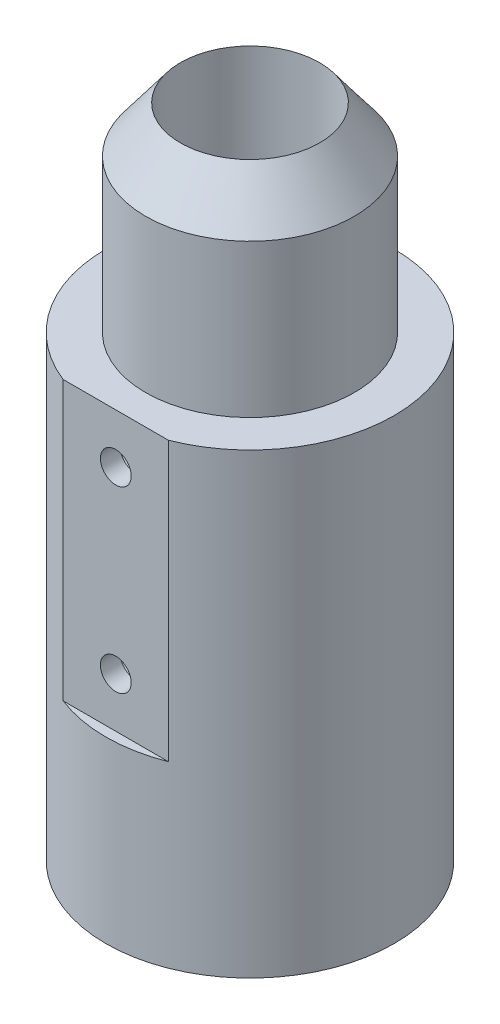
ISO-10303-21;
HEADER;
FILE_DESCRIPTION(('STEP AP214'),'2;1');
FILE_NAME('part.step','',(''),(''),'','','');
FILE_SCHEMA(('AUTOMOTIVE_DESIGN { 1 0 10303 214 1 1 1 1 }'));
ENDSEC;
DATA;
#1=APPLICATION_CONTEXT('core data for automotive mechanical design processes');
#2=APPLICATION_PROTOCOL_DEFINITION('international standard','automotive_design',2000,#1);
#3=PRODUCT_CONTEXT('',#1,'mechanical');
#4=PRODUCT('Part','Part','',(#3));
#5=PRODUCT_RELATED_PRODUCT_CATEGORY('part','',(#4));
#6=PRODUCT_DEFINITION_FORMATION('','',#4);
#7=PRODUCT_DEFINITION_CONTEXT('part definition',#1,'design');
#8=PRODUCT_DEFINITION('design','',#6,#7);
#9=PRODUCT_DEFINITION_SHAPE('','',#8);
#10=(LENGTH_UNIT() NAMED_UNIT(*) SI_UNIT(.MILLI.,.METRE.));
#11=(NAMED_UNIT(*) PLANE_ANGLE_UNIT() SI_UNIT($,.RADIAN.));
#12=(NAMED_UNIT(*) SI_UNIT($,.STERADIAN.) SOLID_ANGLE_UNIT());
#13=UNCERTAINTY_MEASURE_WITH_UNIT(LENGTH_MEASURE(1.E-05),#10,'distance_accuracy_value','');
#14=(GEOMETRIC_REPRESENTATION_CONTEXT(3) GLOBAL_UNCERTAINTY_ASSIGNED_CONTEXT((#13)) GLOBAL_UNIT_ASSIGNED_CONTEXT((#10,
#11,#12)) REPRESENTATION_CONTEXT('',''));
#15=CARTESIAN_POINT('',(0.,0.,0.));
#16=DIRECTION('',(0.,0.,1.));
#17=DIRECTION('',(1.,0.,0.));
#18=AXIS2_PLACEMENT_3D('',#15,#16,#17);
#19=CARTESIAN_POINT('',(0.,76.2,0.));
#20=DIRECTION('',(0.,-1.,0.));
#21=DIRECTION('',(0.,0.,-1.));
#22=AXIS2_PLACEMENT_3D('',#19,#20,#21);
#23=CYLINDRICAL_SURFACE('',#22,23.01875);
#24=CARTESIAN_POINT('',(0.,76.2,0.));
#25=DIRECTION('',(0.,1.,0.));
#26=DIRECTION('',(0.,0.,1.));
#27=AXIS2_PLACEMENT_3D('',#24,#25,#26);
#28=CIRCLE('',#27,23.01875);
#29=CARTESIAN_POINT('',(8.40026041263007,76.2,21.43125));
#30=VERTEX_POINT('',#29);
#31=CARTESIAN_POINT('',(-8.40026041263007,76.2,21.43125));
#32=VERTEX_POINT('',#31);
#33=EDGE_CURVE('E13',#30,#32,#28,.T.);
#34=ORIENTED_EDGE('',*,*,#33,.F.);
#35=DIRECTION('',(0.,1.,0.));
#36=VECTOR('',#35,1.);
#37=CARTESIAN_POINT('',(8.40026041263007,31.75,21.43125));
#38=LINE('',#37,#36);
#39=CARTESIAN_POINT('',(8.40026041263007,31.75,21.43125));
#40=VERTEX_POINT('',#39);
#41=EDGE_CURVE('E89',#40,#30,#38,.T.);
#42=ORIENTED_EDGE('',*,*,#41,.F.);
#43=CARTESIAN_POINT('',(0.,31.75,0.));
#44=DIRECTION('',(0.,1.,0.));
#45=DIRECTION('',(0.,0.,1.));
#46=AXIS2_PLACEMENT_3D('',#43,#44,#45);
#47=CIRCLE('',#46,23.01875);
#48=CARTESIAN_POINT('',(-8.40026041263007,31.75,21.43125));
#49=VERTEX_POINT('',#48);
#50=EDGE_CURVE('E79',#49,#40,#47,.T.);
#51=ORIENTED_EDGE('',*,*,#50,.F.);
#52=DIRECTION('',(0.,1.,0.));
#53=VECTOR('',#52,1.);
#54=CARTESIAN_POINT('',(-8.40026041263007,31.75,21.43125));
#55=LINE('',#54,#53);
#56=EDGE_CURVE('E132',#49,#32,#55,.T.);
#57=ORIENTED_EDGE('',*,*,#56,.T.);
#58=EDGE_LOOP('',(#34,#42,#51,#57));
#59=FACE_BOUND('',#58,.T.);
#60=CARTESIAN_POINT('',(0.,3.17499999999998,0.));
#61=DIRECTION('',(0.,-1.,0.));
#62=DIRECTION('',(0.,0.,-1.));
#63=AXIS2_PLACEMENT_3D('',#60,#61,#62);
#64=CIRCLE('',#63,23.01875);
#65=CARTESIAN_POINT('',(0.,3.17499999999998,-23.01875));
#66=VERTEX_POINT('',#65);
#67=EDGE_CURVE('E121',#66,#66,#64,.T.);
#68=ORIENTED_EDGE('',*,*,#67,.F.);
#69=EDGE_LOOP('',(#68));
#70=FACE_BOUND('',#69,.T.);
#71=ADVANCED_FACE('F57',(#59,#70),#23,.T.);
#72=CARTESIAN_POINT('',(0.,76.2,0.));
#73=DIRECTION('',(0.,-1.,0.));
#74=DIRECTION('',(0.,0.,-1.));
#75=AXIS2_PLACEMENT_3D('',#72,#73,#74);
#76=CYLINDRICAL_SURFACE('',#75,11.1125);
#77=CARTESIAN_POINT('',(0.,107.95,0.));
#78=DIRECTION('',(0.,-1.,0.));
#79=DIRECTION('',(0.,0.,-1.));
#80=AXIS2_PLACEMENT_3D('',#77,#78,#79);
#81=CIRCLE('',#80,11.1125);
#82=CARTESIAN_POINT('',(0.,107.95,-11.1125));
#83=VERTEX_POINT('',#82);
#84=EDGE_CURVE('E142',#83,#83,#81,.T.);
#85=ORIENTED_EDGE('',*,*,#84,.F.);
#86=EDGE_LOOP('',(#85));
#87=FACE_BOUND('',#86,.T.);
#88=CARTESIAN_POINT('',(0.,0.482348804253477,0.));
#89=DIRECTION('',(0.,1.,0.));
#90=DIRECTION('',(0.,0.,1.));
#91=AXIS2_PLACEMENT_3D('',#88,#89,#90);
#92=CIRCLE('',#91,11.1125);
#93=CARTESIAN_POINT('',(0.,0.482348804253477,11.1125));
#94=VERTEX_POINT('',#93);
#95=EDGE_CURVE('E60',#94,#94,#92,.F.);
#96=ORIENTED_EDGE('',*,*,#95,.T.);
#97=EDGE_LOOP('',(#96));
#98=FACE_BOUND('',#97,.T.);
#99=ADVANCED_FACE('F154',(#87,#98),#76,.F.);
#100=CARTESIAN_POINT('',(0.,76.2,0.));
#101=DIRECTION('',(0.,1.,0.));
#102=DIRECTION('',(0.,0.,1.));
#103=AXIS2_PLACEMENT_3D('',#100,#101,#102);
#104=PLANE('',#103);
#105=DIRECTION('',(-1.,0.,0.));
#106=VECTOR('',#105,1.);
#107=CARTESIAN_POINT('',(8.40026041263007,76.2,21.43125));
#108=LINE('',#107,#106);
#109=EDGE_CURVE('E127',#30,#32,#108,.T.);
#110=ORIENTED_EDGE('',*,*,#109,.F.);
#111=ORIENTED_EDGE('',*,*,#33,.T.);
#112=EDGE_LOOP('',(#110,#111));
#113=FACE_BOUND('',#112,.T.);
#114=CARTESIAN_POINT('',(0.,76.2,0.));
#115=DIRECTION('',(0.,1.,0.));
#116=DIRECTION('',(0.,0.,1.));
#117=AXIS2_PLACEMENT_3D('',#114,#115,#116);
#118=CIRCLE('',#117,16.66875);
#119=CARTESIAN_POINT('',(0.,76.2,16.66875));
#120=VERTEX_POINT('',#119);
#121=EDGE_CURVE('E66',#120,#120,#118,.T.);
#122=ORIENTED_EDGE('',*,*,#121,.F.);
#123=EDGE_LOOP('',(#122));
#124=FACE_BOUND('',#123,.T.);
#125=ADVANCED_FACE('F152',(#113,#124),#104,.T.);
#126=CARTESIAN_POINT('',(0.,107.95,0.));
#127=DIRECTION('',(0.,-1.,0.));
#128=DIRECTION('',(0.,0.,-1.));
#129=AXIS2_PLACEMENT_3D('',#126,#127,#128);
#130=CYLINDRICAL_SURFACE('',#129,16.66875);
#131=CARTESIAN_POINT('',(0.,100.576607209871,0.));
#132=DIRECTION('',(0.,-1.,0.));
#133=DIRECTION('',(0.,0.,-1.));
#134=AXIS2_PLACEMENT_3D('',#131,#132,#133);
#135=CIRCLE('',#134,16.66875);
#136=CARTESIAN_POINT('',(0.,100.576607209871,-16.66875));
#137=VERTEX_POINT('',#136);
#138=EDGE_CURVE('E136',#137,#137,#135,.T.);
#139=ORIENTED_EDGE('',*,*,#138,.T.);
#140=EDGE_LOOP('',(#139));
#141=FACE_BOUND('',#140,.T.);
#142=ORIENTED_EDGE('',*,*,#121,.T.);
#143=EDGE_LOOP('',(#142));
#144=FACE_BOUND('',#143,.T.);
#145=ADVANCED_FACE('F150',(#141,#144),#130,.T.);
#146=CARTESIAN_POINT('',(0.,107.95,0.));
#147=DIRECTION('',(0.,-1.,0.));
#148=DIRECTION('',(0.,0.,-1.));
#149=AXIS2_PLACEMENT_3D('',#146,#147,#148);
#150=CONICAL_SURFACE('',#149,11.1125,0.645771823237896);
#151=ORIENTED_EDGE('',*,*,#138,.F.);
#152=EDGE_LOOP('',(#151));
#153=FACE_BOUND('',#152,.T.);
#154=ORIENTED_EDGE('',*,*,#84,.T.);
#155=EDGE_LOOP('',(#154));
#156=FACE_BOUND('',#155,.T.);
#157=ADVANCED_FACE('F160',(#153,#156),#150,.T.);
#158=CARTESIAN_POINT('',(8.40026041263007,31.75,21.43125));
#159=DIRECTION('',(0.,0.,-1.));
#160=DIRECTION('',(-1.,0.,0.));
#161=AXIS2_PLACEMENT_3D('',#158,#159,#160);
#162=PLANE('',#161);
#163=CARTESIAN_POINT('',(0.,68.2625,21.43125));
#164=DIRECTION('',(0.,0.,1.));
#165=DIRECTION('',(1.,0.,0.));
#166=AXIS2_PLACEMENT_3D('',#163,#164,#165);
#167=CIRCLE('',#166,2.45744999999999);
#168=CARTESIAN_POINT('',(2.45744999999999,68.2625,21.43125));
#169=VERTEX_POINT('',#168);
#170=EDGE_CURVE('E108',#169,#169,#167,.T.);
#171=ORIENTED_EDGE('',*,*,#170,.F.);
#172=EDGE_LOOP('',(#171));
#173=FACE_BOUND('',#172,.T.);
#174=CARTESIAN_POINT('',(0.,39.6875,21.43125));
#175=DIRECTION('',(0.,0.,1.));
#176=DIRECTION('',(1.,0.,0.));
#177=AXIS2_PLACEMENT_3D('',#174,#175,#176);
#178=CIRCLE('',#177,2.45744999999999);
#179=CARTESIAN_POINT('',(2.45744999999999,39.6875,21.43125));
#180=VERTEX_POINT('',#179);
#181=EDGE_CURVE('E107',#180,#180,#178,.T.);
#182=ORIENTED_EDGE('',*,*,#181,.F.);
#183=EDGE_LOOP('',(#182));
#184=FACE_BOUND('',#183,.T.);
#185=ORIENTED_EDGE('',*,*,#109,.T.);
#186=ORIENTED_EDGE('',*,*,#56,.F.);
#187=DIRECTION('',(-1.,0.,0.));
#188=VECTOR('',#187,1.);
#189=CARTESIAN_POINT('',(8.40026041263007,31.75,21.43125));
#190=LINE('',#189,#188);
#191=EDGE_CURVE('E74',#40,#49,#190,.T.);
#192=ORIENTED_EDGE('',*,*,#191,.F.);
#193=ORIENTED_EDGE('',*,*,#41,.T.);
#194=EDGE_LOOP('',(#185,#186,#192,#193));
#195=FACE_BOUND('',#194,.T.);
#196=ADVANCED_FACE('F184',(#173,#184,#195),#162,.F.);
#197=CARTESIAN_POINT('',(0.,31.75,0.));
#198=DIRECTION('',(0.,1.,0.));
#199=DIRECTION('',(0.,0.,1.));
#200=AXIS2_PLACEMENT_3D('',#197,#198,#199);
#201=PLANE('',#200);
#202=ORIENTED_EDGE('',*,*,#50,.T.);
#203=ORIENTED_EDGE('',*,*,#191,.T.);
#204=EDGE_LOOP('',(#202,#203));
#205=FACE_BOUND('',#204,.T.);
#206=ADVANCED_FACE('F176',(#205),#201,.T.);
#207=CARTESIAN_POINT('',(0.,62.3897733940628,0.));
#208=DIRECTION('',(0.,-1.,0.));
#209=DIRECTION('',(0.,0.,-1.));
#210=AXIS2_PLACEMENT_3D('',#207,#208,#209);
#211=DEGENERATE_TOROIDAL_SURFACE('',#210,3.3694641083372,62.3897733940628,.T.);
#212=ORIENTED_EDGE('',*,*,#95,.F.);
#213=EDGE_LOOP('',(#212));
#214=FACE_BOUND('',#213,.T.);
#215=ORIENTED_EDGE('',*,*,#67,.T.);
#216=EDGE_LOOP('',(#215));
#217=FACE_BOUND('',#216,.T.);
#218=ADVANCED_FACE('F173',(#214,#217),#211,.T.);
#219=CARTESIAN_POINT('',(0.,39.6875,18.25625));
#220=DIRECTION('',(0.,0.,1.));
#221=DIRECTION('',(1.,0.,0.));
#222=AXIS2_PLACEMENT_3D('',#219,#220,#221);
#223=CONICAL_SURFACE('',#222,2.45745,1.02974425867665);
#224=CARTESIAN_POINT('',(0.,39.6875,16.7796650717707));
#225=VERTEX_POINT('',#224);
#226=VERTEX_LOOP('',#225);
#227=FACE_BOUND('',#226,.T.);
#228=CARTESIAN_POINT('',(0.,39.6875,18.25625));
#229=DIRECTION('',(0.,0.,1.));
#230=DIRECTION('',(1.,0.,0.));
#231=AXIS2_PLACEMENT_3D('',#228,#229,#230);
#232=CIRCLE('',#231,2.45745);
#233=CARTESIAN_POINT('',(2.45745,39.6875,18.25625));
#234=VERTEX_POINT('',#233);
#235=EDGE_CURVE('E113',#234,#234,#232,.T.);
#236=ORIENTED_EDGE('',*,*,#235,.T.);
#237=EDGE_LOOP('',(#236));
#238=FACE_BOUND('',#237,.T.);
#239=ADVANCED_FACE('F175',(#227,#238),#223,.F.);
#240=CARTESIAN_POINT('',(0.,39.6875,21.43125));
#241=DIRECTION('',(0.,0.,1.));
#242=DIRECTION('',(1.,0.,0.));
#243=AXIS2_PLACEMENT_3D('',#240,#241,#242);
#244=CYLINDRICAL_SURFACE('',#243,2.45744999999999);
#245=ORIENTED_EDGE('',*,*,#235,.F.);
#246=EDGE_LOOP('',(#245));
#247=FACE_BOUND('',#246,.T.);
#248=ORIENTED_EDGE('',*,*,#181,.T.);
#249=EDGE_LOOP('',(#248));
#250=FACE_BOUND('',#249,.T.);
#251=ADVANCED_FACE('F100',(#247,#250),#244,.F.);
#252=CARTESIAN_POINT('',(0.,68.2625,18.25625));
#253=DIRECTION('',(0.,0.,1.));
#254=DIRECTION('',(1.,0.,0.));
#255=AXIS2_PLACEMENT_3D('',#252,#253,#254);
#256=CONICAL_SURFACE('',#255,2.45745,1.02974425867665);
#257=CARTESIAN_POINT('',(0.,68.2625,16.7796650717707));
#258=VERTEX_POINT('',#257);
#259=VERTEX_LOOP('',#258);
#260=FACE_BOUND('',#259,.T.);
#261=CARTESIAN_POINT('',(0.,68.2625,18.25625));
#262=DIRECTION('',(0.,0.,1.));
#263=DIRECTION('',(1.,0.,0.));
#264=AXIS2_PLACEMENT_3D('',#261,#262,#263);
#265=CIRCLE('',#264,2.45745);
#266=CARTESIAN_POINT('',(2.45745,68.2625,18.25625));
#267=VERTEX_POINT('',#266);
#268=EDGE_CURVE('E104',#267,#267,#265,.T.);
#269=ORIENTED_EDGE('',*,*,#268,.T.);
#270=EDGE_LOOP('',(#269));
#271=FACE_BOUND('',#270,.T.);
#272=ADVANCED_FACE('F96',(#260,#271),#256,.F.);
#273=CARTESIAN_POINT('',(0.,68.2625,21.43125));
#274=DIRECTION('',(0.,0.,1.));
#275=DIRECTION('',(1.,0.,0.));
#276=AXIS2_PLACEMENT_3D('',#273,#274,#275);
#277=CYLINDRICAL_SURFACE('',#276,2.45744999999999);
#278=ORIENTED_EDGE('',*,*,#268,.F.);
#279=EDGE_LOOP('',(#278));
#280=FACE_BOUND('',#279,.T.);
#281=ORIENTED_EDGE('',*,*,#170,.T.);
#282=EDGE_LOOP('',(#281));
#283=FACE_BOUND('',#282,.T.);
#284=ADVANCED_FACE('F99',(#280,#283),#277,.F.);
#285=CLOSED_SHELL('',(#71,#99,#125,#145,#157,#196,#206,#218,#239,#251,#272,#284));
#286=MANIFOLD_SOLID_BREP('B2',#285);
#287=ADVANCED_BREP_SHAPE_REPRESENTATION('',(#18,#286),#14);
#288=SHAPE_DEFINITION_REPRESENTATION(#9,#287);
ENDSEC;
END-ISO-10303-21;
